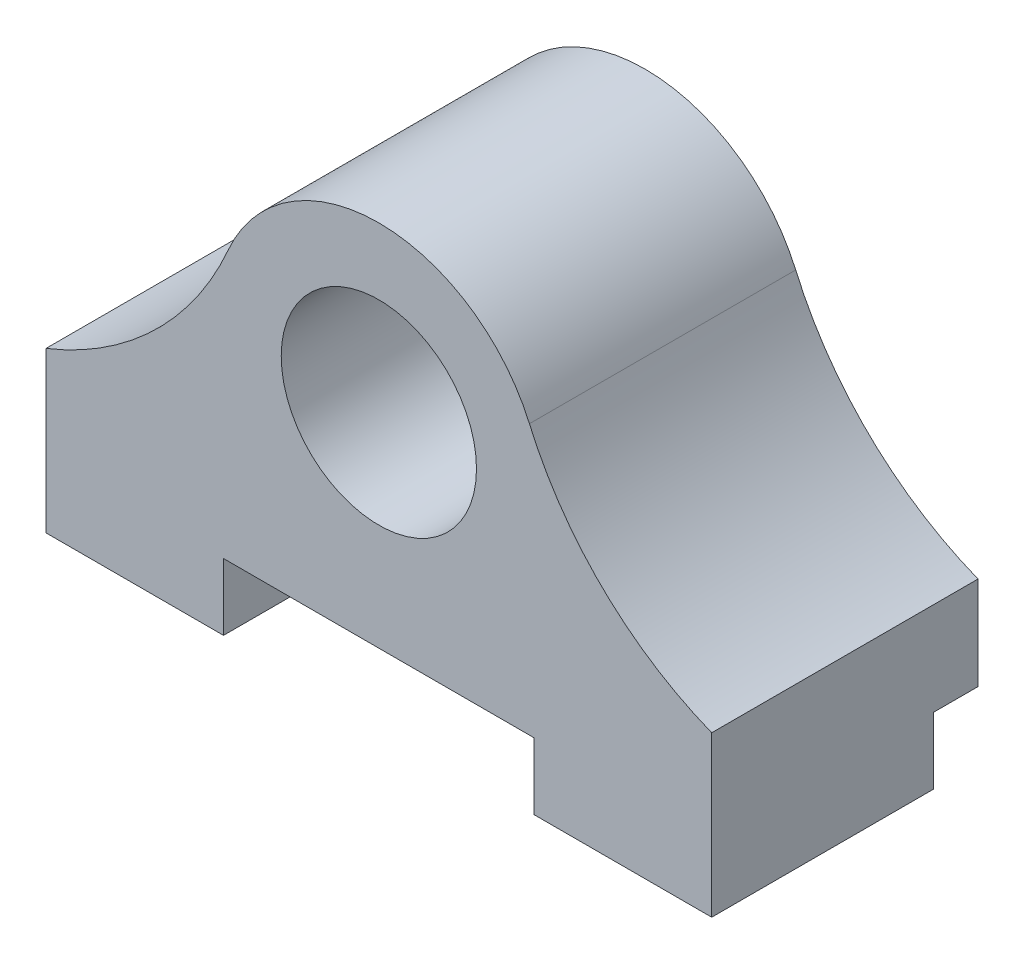
ISO-10303-21;
HEADER;
FILE_DESCRIPTION(('STEP AP214'),'2;1');
FILE_NAME('part.step','',(''),(''),'','','');
FILE_SCHEMA(('AUTOMOTIVE_DESIGN { 1 0 10303 214 1 1 1 1 }'));
ENDSEC;
DATA;
#1=APPLICATION_CONTEXT('core data for automotive mechanical design processes');
#2=APPLICATION_PROTOCOL_DEFINITION('international standard','automotive_design',2000,#1);
#3=PRODUCT_CONTEXT('',#1,'mechanical');
#4=PRODUCT('Part','Part','',(#3));
#5=PRODUCT_RELATED_PRODUCT_CATEGORY('part','',(#4));
#6=PRODUCT_DEFINITION_FORMATION('','',#4);
#7=PRODUCT_DEFINITION_CONTEXT('part definition',#1,'design');
#8=PRODUCT_DEFINITION('design','',#6,#7);
#9=PRODUCT_DEFINITION_SHAPE('','',#8);
#10=(LENGTH_UNIT() NAMED_UNIT(*) SI_UNIT(.MILLI.,.METRE.));
#11=(NAMED_UNIT(*) PLANE_ANGLE_UNIT() SI_UNIT($,.RADIAN.));
#12=(NAMED_UNIT(*) SI_UNIT($,.STERADIAN.) SOLID_ANGLE_UNIT());
#13=UNCERTAINTY_MEASURE_WITH_UNIT(LENGTH_MEASURE(1.E-05),#10,'distance_accuracy_value','');
#14=(GEOMETRIC_REPRESENTATION_CONTEXT(3) GLOBAL_UNCERTAINTY_ASSIGNED_CONTEXT((#13)) GLOBAL_UNIT_ASSIGNED_CONTEXT((#10,
#11,#12)) REPRESENTATION_CONTEXT('',''));
#15=CARTESIAN_POINT('',(0.,0.,0.));
#16=DIRECTION('',(0.,0.,1.));
#17=DIRECTION('',(1.,0.,0.));
#18=AXIS2_PLACEMENT_3D('',#15,#16,#17);
#19=CARTESIAN_POINT('',(0.,-12.2,0.));
#20=DIRECTION('',(0.,-1.,0.));
#21=DIRECTION('',(0.,0.,-1.));
#22=AXIS2_PLACEMENT_3D('',#19,#20,#21);
#23=PLANE('',#22);
#24=DIRECTION('',(0.,0.,1.));
#25=VECTOR('',#24,1.);
#26=CARTESIAN_POINT('',(6.99999999999999,-12.2,-2.));
#27=LINE('',#26,#25);
#28=CARTESIAN_POINT('',(6.99999999999999,-12.2,0.));
#29=VERTEX_POINT('',#28);
#30=CARTESIAN_POINT('',(6.99999999999999,-12.2,10.));
#31=VERTEX_POINT('',#30);
#32=EDGE_CURVE('E137',#29,#31,#27,.T.);
#33=ORIENTED_EDGE('',*,*,#32,.F.);
#34=DIRECTION('',(-1.,0.,0.));
#35=VECTOR('',#34,1.);
#36=CARTESIAN_POINT('',(15.,-12.2,0.));
#37=LINE('',#36,#35);
#38=CARTESIAN_POINT('',(15.,-12.2,0.));
#39=VERTEX_POINT('',#38);
#40=EDGE_CURVE('E158',#39,#29,#37,.T.);
#41=ORIENTED_EDGE('',*,*,#40,.F.);
#42=DIRECTION('',(0.,0.,1.));
#43=VECTOR('',#42,1.);
#44=CARTESIAN_POINT('',(15.,-12.2,10.));
#45=LINE('',#44,#43);
#46=CARTESIAN_POINT('',(15.,-12.2,10.));
#47=VERTEX_POINT('',#46);
#48=EDGE_CURVE('E188',#39,#47,#45,.T.);
#49=ORIENTED_EDGE('',*,*,#48,.T.);
#50=DIRECTION('',(-1.,0.,0.));
#51=VECTOR('',#50,1.);
#52=CARTESIAN_POINT('',(-15.,-12.2,10.));
#53=LINE('',#52,#51);
#54=EDGE_CURVE('E190',#47,#31,#53,.T.);
#55=ORIENTED_EDGE('',*,*,#54,.T.);
#56=EDGE_LOOP('',(#33,#41,#49,#55));
#57=FACE_BOUND('',#56,.T.);
#58=CARTESIAN_POINT('',(11.5,-12.2,4.));
#59=DIRECTION('',(0.,-1.,0.));
#60=DIRECTION('',(0.,0.,-1.));
#61=AXIS2_PLACEMENT_3D('',#58,#59,#60);
#62=CIRCLE('',#61,1.65);
#63=CARTESIAN_POINT('',(11.5,-12.2,2.35));
#64=VERTEX_POINT('',#63);
#65=EDGE_CURVE('E181',#64,#64,#62,.T.);
#66=ORIENTED_EDGE('',*,*,#65,.F.);
#67=EDGE_LOOP('',(#66));
#68=FACE_BOUND('',#67,.T.);
#69=ADVANCED_FACE('F39',(#57,#68),#23,.T.);
#70=CARTESIAN_POINT('',(0.,0.,0.));
#71=DIRECTION('',(0.,0.,1.));
#72=DIRECTION('',(1.,0.,0.));
#73=AXIS2_PLACEMENT_3D('',#70,#71,#72);
#74=PLANE('',#73);
#75=ORIENTED_EDGE('',*,*,#40,.T.);
#76=DIRECTION('',(0.,1.,0.));
#77=VECTOR('',#76,1.);
#78=CARTESIAN_POINT('',(6.99999999999999,0.,0.));
#79=LINE('',#78,#77);
#80=CARTESIAN_POINT('',(6.99999999999999,-9.2,0.));
#81=VERTEX_POINT('',#80);
#82=EDGE_CURVE('E11',#29,#81,#79,.T.);
#83=ORIENTED_EDGE('',*,*,#82,.T.);
#84=DIRECTION('',(1.,0.,0.));
#85=VECTOR('',#84,1.);
#86=CARTESIAN_POINT('',(15.,-9.2,0.));
#87=LINE('',#86,#85);
#88=CARTESIAN_POINT('',(15.,-9.2,0.));
#89=VERTEX_POINT('',#88);
#90=EDGE_CURVE('E162',#81,#89,#87,.T.);
#91=ORIENTED_EDGE('',*,*,#90,.T.);
#92=DIRECTION('',(0.,-1.,0.));
#93=VECTOR('',#92,1.);
#94=CARTESIAN_POINT('',(15.,-12.2,0.));
#95=LINE('',#94,#93);
#96=EDGE_CURVE('E62',#89,#39,#95,.T.);
#97=ORIENTED_EDGE('',*,*,#96,.T.);
#98=EDGE_LOOP('',(#75,#83,#91,#97));
#99=FACE_BOUND('',#98,.T.);
#100=ADVANCED_FACE('F268',(#99),#74,.F.);
#101=CARTESIAN_POINT('',(0.,0.,-2.));
#102=DIRECTION('',(0.,0.,1.));
#103=DIRECTION('',(1.,0.,0.));
#104=AXIS2_PLACEMENT_3D('',#101,#102,#103);
#105=PLANE('',#104);
#106=DIRECTION('',(1.,0.,0.));
#107=VECTOR('',#106,1.);
#108=CARTESIAN_POINT('',(0.,-9.2,-2.));
#109=LINE('',#108,#107);
#110=CARTESIAN_POINT('',(-15.,-9.2,-2.));
#111=VERTEX_POINT('',#110);
#112=CARTESIAN_POINT('',(15.,-9.2,-2.));
#113=VERTEX_POINT('',#112);
#114=EDGE_CURVE('E171',#111,#113,#109,.T.);
#115=ORIENTED_EDGE('',*,*,#114,.F.);
#116=DIRECTION('',(0.,1.,0.));
#117=VECTOR('',#116,1.);
#118=CARTESIAN_POINT('',(-15.,-12.2,-2.));
#119=LINE('',#118,#117);
#120=CARTESIAN_POINT('',(-15.,-5.,-2.));
#121=VERTEX_POINT('',#120);
#122=EDGE_CURVE('E199',#111,#121,#119,.T.);
#123=ORIENTED_EDGE('',*,*,#122,.T.);
#124=CARTESIAN_POINT('',(-20.5386621432639,8.93998642979166,-2.));
#125=DIRECTION('',(0.,0.,1.));
#126=DIRECTION('',(1.,0.,0.));
#127=AXIS2_PLACEMENT_3D('',#124,#125,#126);
#128=CIRCLE('',#127,15.);
#129=CARTESIAN_POINT('',(-6.78509374375682,2.9533883741276,-2.));
#130=VERTEX_POINT('',#129);
#131=EDGE_CURVE('E204',#130,#121,#128,.F.);
#132=ORIENTED_EDGE('',*,*,#131,.F.);
#133=CARTESIAN_POINT('',(0.,0.,-2.));
#134=DIRECTION('',(0.,0.,1.));
#135=DIRECTION('',(1.,0.,0.));
#136=AXIS2_PLACEMENT_3D('',#133,#134,#135);
#137=CIRCLE('',#136,7.4);
#138=CARTESIAN_POINT('',(6.78509374375682,2.9533883741276,-2.));
#139=VERTEX_POINT('',#138);
#140=EDGE_CURVE('E201',#130,#139,#137,.F.);
#141=ORIENTED_EDGE('',*,*,#140,.T.);
#142=CARTESIAN_POINT('',(20.5386621432639,8.93998642979166,-2.));
#143=DIRECTION('',(0.,0.,1.));
#144=DIRECTION('',(1.,0.,0.));
#145=AXIS2_PLACEMENT_3D('',#142,#143,#144);
#146=CIRCLE('',#145,15.);
#147=CARTESIAN_POINT('',(15.,-5.,-2.));
#148=VERTEX_POINT('',#147);
#149=EDGE_CURVE('E207',#139,#148,#146,.T.);
#150=ORIENTED_EDGE('',*,*,#149,.T.);
#151=DIRECTION('',(0.,1.,0.));
#152=VECTOR('',#151,1.);
#153=CARTESIAN_POINT('',(15.,-12.2,-2.));
#154=LINE('',#153,#152);
#155=EDGE_CURVE('E197',#113,#148,#154,.T.);
#156=ORIENTED_EDGE('',*,*,#155,.F.);
#157=EDGE_LOOP('',(#115,#123,#132,#141,#150,#156));
#158=FACE_BOUND('',#157,.T.);
#159=ADVANCED_FACE('F247',(#158),#105,.F.);
#160=CARTESIAN_POINT('',(-15.,-12.2,10.));
#161=DIRECTION('',(1.,0.,0.));
#162=DIRECTION('',(0.,0.,-1.));
#163=AXIS2_PLACEMENT_3D('',#160,#161,#162);
#164=PLANE('',#163);
#165=DIRECTION('',(0.,0.,1.));
#166=VECTOR('',#165,1.);
#167=CARTESIAN_POINT('',(-15.,-9.2,-2.000012));
#168=LINE('',#167,#166);
#169=CARTESIAN_POINT('',(-15.,-9.2,0.));
#170=VERTEX_POINT('',#169);
#171=EDGE_CURVE('E168',#111,#170,#168,.T.);
#172=ORIENTED_EDGE('',*,*,#171,.T.);
#173=DIRECTION('',(0.,1.,0.));
#174=VECTOR('',#173,1.);
#175=CARTESIAN_POINT('',(-15.,-12.2,0.));
#176=LINE('',#175,#174);
#177=CARTESIAN_POINT('',(-15.,-12.2,0.));
#178=VERTEX_POINT('',#177);
#179=EDGE_CURVE('E160',#178,#170,#176,.T.);
#180=ORIENTED_EDGE('',*,*,#179,.F.);
#181=DIRECTION('',(0.,0.,-1.));
#182=VECTOR('',#181,1.);
#183=CARTESIAN_POINT('',(-15.,-12.2,10.));
#184=LINE('',#183,#182);
#185=CARTESIAN_POINT('',(-15.,-12.2,10.));
#186=VERTEX_POINT('',#185);
#187=EDGE_CURVE('E177',#186,#178,#184,.T.);
#188=ORIENTED_EDGE('',*,*,#187,.F.);
#189=DIRECTION('',(0.,1.,0.));
#190=VECTOR('',#189,1.);
#191=CARTESIAN_POINT('',(-15.,-12.2,10.));
#192=LINE('',#191,#190);
#193=CARTESIAN_POINT('',(-15.,-5.,10.));
#194=VERTEX_POINT('',#193);
#195=EDGE_CURVE('E193',#186,#194,#192,.T.);
#196=ORIENTED_EDGE('',*,*,#195,.T.);
#197=DIRECTION('',(0.,0.,-1.));
#198=VECTOR('',#197,1.);
#199=CARTESIAN_POINT('',(-15.,-5.,10.));
#200=LINE('',#199,#198);
#201=EDGE_CURVE('E230',#194,#121,#200,.T.);
#202=ORIENTED_EDGE('',*,*,#201,.T.);
#203=ORIENTED_EDGE('',*,*,#122,.F.);
#204=EDGE_LOOP('',(#172,#180,#188,#196,#202,#203));
#205=FACE_BOUND('',#204,.T.);
#206=ADVANCED_FACE('F241',(#205),#164,.F.);
#207=CARTESIAN_POINT('',(15.,-12.2,10.));
#208=DIRECTION('',(-1.,0.,0.));
#209=DIRECTION('',(0.,0.,1.));
#210=AXIS2_PLACEMENT_3D('',#207,#208,#209);
#211=PLANE('',#210);
#212=DIRECTION('',(0.,0.,1.));
#213=VECTOR('',#212,1.);
#214=CARTESIAN_POINT('',(15.,-9.2,-2.000012));
#215=LINE('',#214,#213);
#216=EDGE_CURVE('E165',#113,#89,#215,.T.);
#217=ORIENTED_EDGE('',*,*,#216,.F.);
#218=ORIENTED_EDGE('',*,*,#155,.T.);
#219=DIRECTION('',(0.,0.,-1.));
#220=VECTOR('',#219,1.);
#221=CARTESIAN_POINT('',(15.,-5.,10.));
#222=LINE('',#221,#220);
#223=CARTESIAN_POINT('',(15.,-5.,10.));
#224=VERTEX_POINT('',#223);
#225=EDGE_CURVE('E227',#224,#148,#222,.T.);
#226=ORIENTED_EDGE('',*,*,#225,.F.);
#227=DIRECTION('',(0.,1.,0.));
#228=VECTOR('',#227,1.);
#229=CARTESIAN_POINT('',(15.,-12.2,10.));
#230=LINE('',#229,#228);
#231=EDGE_CURVE('E195',#47,#224,#230,.T.);
#232=ORIENTED_EDGE('',*,*,#231,.F.);
#233=ORIENTED_EDGE('',*,*,#48,.F.);
#234=ORIENTED_EDGE('',*,*,#96,.F.);
#235=EDGE_LOOP('',(#217,#218,#226,#232,#233,#234));
#236=FACE_BOUND('',#235,.T.);
#237=ADVANCED_FACE('F265',(#236),#211,.F.);
#238=CARTESIAN_POINT('',(-20.5386621432639,8.93998642979166,10.));
#239=DIRECTION('',(0.,0.,-1.));
#240=DIRECTION('',(-1.,0.,0.));
#241=AXIS2_PLACEMENT_3D('',#238,#239,#240);
#242=PLANE('',#241);
#243=DIRECTION('',(1.,0.,0.));
#244=VECTOR('',#243,1.);
#245=CARTESIAN_POINT('',(-20.5386621432639,-9.2,10.));
#246=LINE('',#245,#244);
#247=CARTESIAN_POINT('',(-7.00000000000001,-9.2,10.));
#248=VERTEX_POINT('',#247);
#249=CARTESIAN_POINT('',(6.99999999999999,-9.2,10.));
#250=VERTEX_POINT('',#249);
#251=EDGE_CURVE('E129',#248,#250,#246,.T.);
#252=ORIENTED_EDGE('',*,*,#251,.T.);
#253=DIRECTION('',(0.,-1.,0.));
#254=VECTOR('',#253,1.);
#255=CARTESIAN_POINT('',(7.,8.93998642979166,10.));
#256=LINE('',#255,#254);
#257=EDGE_CURVE('E151',#250,#31,#256,.T.);
#258=ORIENTED_EDGE('',*,*,#257,.T.);
#259=ORIENTED_EDGE('',*,*,#54,.F.);
#260=ORIENTED_EDGE('',*,*,#231,.T.);
#261=CARTESIAN_POINT('',(20.5386621432639,8.93998642979166,10.));
#262=DIRECTION('',(0.,0.,-1.));
#263=DIRECTION('',(1.,0.,0.));
#264=AXIS2_PLACEMENT_3D('',#261,#262,#263);
#265=CIRCLE('',#264,15.);
#266=CARTESIAN_POINT('',(6.78509374375682,2.9533883741276,10.));
#267=VERTEX_POINT('',#266);
#268=EDGE_CURVE('E219',#224,#267,#265,.T.);
#269=ORIENTED_EDGE('',*,*,#268,.T.);
#270=CARTESIAN_POINT('',(0.,0.,10.));
#271=DIRECTION('',(0.,0.,1.));
#272=DIRECTION('',(-1.,0.,0.));
#273=AXIS2_PLACEMENT_3D('',#270,#271,#272);
#274=CIRCLE('',#273,7.4);
#275=CARTESIAN_POINT('',(-6.78509374375682,2.9533883741276,10.));
#276=VERTEX_POINT('',#275);
#277=EDGE_CURVE('E221',#267,#276,#274,.T.);
#278=ORIENTED_EDGE('',*,*,#277,.T.);
#279=CARTESIAN_POINT('',(-20.5386621432639,8.93998642979166,10.));
#280=DIRECTION('',(0.,0.,-1.));
#281=DIRECTION('',(-1.,0.,0.));
#282=AXIS2_PLACEMENT_3D('',#279,#280,#281);
#283=CIRCLE('',#282,15.);
#284=EDGE_CURVE('E214',#276,#194,#283,.T.);
#285=ORIENTED_EDGE('',*,*,#284,.T.);
#286=ORIENTED_EDGE('',*,*,#195,.F.);
#287=CARTESIAN_POINT('',(-7.00000000000001,-12.2,10.));
#288=VERTEX_POINT('',#287);
#289=EDGE_CURVE('E150',#288,#186,#53,.T.);
#290=ORIENTED_EDGE('',*,*,#289,.F.);
#291=DIRECTION('',(0.,1.,0.));
#292=VECTOR('',#291,1.);
#293=CARTESIAN_POINT('',(-7.00000000000001,8.93998642979166,10.));
#294=LINE('',#293,#292);
#295=EDGE_CURVE('E136',#288,#248,#294,.T.);
#296=ORIENTED_EDGE('',*,*,#295,.T.);
#297=EDGE_LOOP('',(#252,#258,#259,#260,#269,#278,#285,#286,#290,#296));
#298=FACE_BOUND('',#297,.T.);
#299=CARTESIAN_POINT('',(0.,0.,10.));
#300=DIRECTION('',(0.,0.,1.));
#301=DIRECTION('',(1.,0.,0.));
#302=AXIS2_PLACEMENT_3D('',#299,#300,#301);
#303=CIRCLE('',#302,4.4);
#304=CARTESIAN_POINT('',(4.4,0.,10.));
#305=VERTEX_POINT('',#304);
#306=EDGE_CURVE('E211',#305,#305,#303,.T.);
#307=ORIENTED_EDGE('',*,*,#306,.F.);
#308=EDGE_LOOP('',(#307));
#309=FACE_BOUND('',#308,.T.);
#310=ADVANCED_FACE('F147',(#298,#309),#242,.F.);
#311=CARTESIAN_POINT('',(-20.5386621432639,8.93998642979166,10.));
#312=DIRECTION('',(0.,0.,-1.));
#313=DIRECTION('',(-1.,0.,0.));
#314=AXIS2_PLACEMENT_3D('',#311,#312,#313);
#315=CYLINDRICAL_SURFACE('',#314,15.);
#316=DIRECTION('',(0.,0.,-1.));
#317=VECTOR('',#316,1.);
#318=CARTESIAN_POINT('',(-6.78509374375682,2.9533883741276,10.));
#319=LINE('',#318,#317);
#320=EDGE_CURVE('E223',#276,#130,#319,.T.);
#321=ORIENTED_EDGE('',*,*,#320,.T.);
#322=ORIENTED_EDGE('',*,*,#131,.T.);
#323=ORIENTED_EDGE('',*,*,#201,.F.);
#324=ORIENTED_EDGE('',*,*,#284,.F.);
#325=EDGE_LOOP('',(#321,#322,#323,#324));
#326=FACE_BOUND('',#325,.T.);
#327=ADVANCED_FACE('F41',(#326),#315,.F.);
#328=CARTESIAN_POINT('',(20.5386621432639,8.93998642979166,10.));
#329=DIRECTION('',(0.,0.,-1.));
#330=DIRECTION('',(-1.,0.,0.));
#331=AXIS2_PLACEMENT_3D('',#328,#329,#330);
#332=CYLINDRICAL_SURFACE('',#331,15.);
#333=ORIENTED_EDGE('',*,*,#225,.T.);
#334=ORIENTED_EDGE('',*,*,#149,.F.);
#335=DIRECTION('',(0.,0.,-1.));
#336=VECTOR('',#335,1.);
#337=CARTESIAN_POINT('',(6.78509374375682,2.9533883741276,10.));
#338=LINE('',#337,#336);
#339=EDGE_CURVE('E225',#267,#139,#338,.T.);
#340=ORIENTED_EDGE('',*,*,#339,.F.);
#341=ORIENTED_EDGE('',*,*,#268,.F.);
#342=EDGE_LOOP('',(#333,#334,#340,#341));
#343=FACE_BOUND('',#342,.T.);
#344=ADVANCED_FACE('F261',(#343),#332,.F.);
#345=CARTESIAN_POINT('',(0.,0.,10.));
#346=DIRECTION('',(0.,0.,-1.));
#347=DIRECTION('',(-1.,0.,0.));
#348=AXIS2_PLACEMENT_3D('',#345,#346,#347);
#349=CYLINDRICAL_SURFACE('',#348,7.4);
#350=ORIENTED_EDGE('',*,*,#339,.T.);
#351=ORIENTED_EDGE('',*,*,#140,.F.);
#352=ORIENTED_EDGE('',*,*,#320,.F.);
#353=ORIENTED_EDGE('',*,*,#277,.F.);
#354=EDGE_LOOP('',(#350,#351,#352,#353));
#355=FACE_BOUND('',#354,.T.);
#356=ADVANCED_FACE('F256',(#355),#349,.T.);
#357=CARTESIAN_POINT('',(0.,0.,10.));
#358=DIRECTION('',(0.,0.,-1.));
#359=DIRECTION('',(-1.,0.,0.));
#360=AXIS2_PLACEMENT_3D('',#357,#358,#359);
#361=CYLINDRICAL_SURFACE('',#360,4.4);
#362=ORIENTED_EDGE('',*,*,#306,.T.);
#363=EDGE_LOOP('',(#362));
#364=FACE_BOUND('',#363,.T.);
#365=CARTESIAN_POINT('',(0.,0.,0.));
#366=DIRECTION('',(0.,0.,1.));
#367=DIRECTION('',(1.,0.,0.));
#368=AXIS2_PLACEMENT_3D('',#365,#366,#367);
#369=CIRCLE('',#368,4.4);
#370=CARTESIAN_POINT('',(4.4,0.,0.));
#371=VERTEX_POINT('',#370);
#372=EDGE_CURVE('E210',#371,#371,#369,.T.);
#373=ORIENTED_EDGE('',*,*,#372,.F.);
#374=EDGE_LOOP('',(#373));
#375=FACE_BOUND('',#374,.T.);
#376=ADVANCED_FACE('F306',(#364,#375),#361,.F.);
#377=CARTESIAN_POINT('',(0.,0.,0.));
#378=DIRECTION('',(0.,0.,1.));
#379=DIRECTION('',(1.,0.,0.));
#380=AXIS2_PLACEMENT_3D('',#377,#378,#379);
#381=PLANE('',#380);
#382=ORIENTED_EDGE('',*,*,#372,.T.);
#383=EDGE_LOOP('',(#382));
#384=FACE_BOUND('',#383,.T.);
#385=ADVANCED_FACE('F293',(#384),#381,.T.);
#386=DIRECTION('',(0.,0.,1.));
#387=VECTOR('',#386,1.);
#388=CARTESIAN_POINT('',(-7.00000000000001,-12.2,-2.));
#389=LINE('',#388,#387);
#390=CARTESIAN_POINT('',(-7.00000000000001,-12.2,0.));
#391=VERTEX_POINT('',#390);
#392=EDGE_CURVE('E144',#391,#288,#389,.T.);
#393=ORIENTED_EDGE('',*,*,#392,.T.);
#394=ORIENTED_EDGE('',*,*,#289,.T.);
#395=ORIENTED_EDGE('',*,*,#187,.T.);
#396=EDGE_CURVE('E157',#391,#178,#37,.T.);
#397=ORIENTED_EDGE('',*,*,#396,.F.);
#398=EDGE_LOOP('',(#393,#394,#395,#397));
#399=FACE_BOUND('',#398,.T.);
#400=CARTESIAN_POINT('',(-11.5,-12.2,4.));
#401=DIRECTION('',(0.,-1.,0.));
#402=DIRECTION('',(0.,0.,-1.));
#403=AXIS2_PLACEMENT_3D('',#400,#401,#402);
#404=CIRCLE('',#403,1.65);
#405=CARTESIAN_POINT('',(-11.5,-12.2,2.35));
#406=VERTEX_POINT('',#405);
#407=EDGE_CURVE('E178',#406,#406,#404,.T.);
#408=ORIENTED_EDGE('',*,*,#407,.F.);
#409=EDGE_LOOP('',(#408));
#410=FACE_BOUND('',#409,.T.);
#411=ADVANCED_FACE('F237',(#399,#410),#23,.T.);
#412=CARTESIAN_POINT('',(11.5,-4.2,4.));
#413=DIRECTION('',(0.,-1.,0.));
#414=DIRECTION('',(0.,0.,-1.));
#415=AXIS2_PLACEMENT_3D('',#412,#413,#414);
#416=CYLINDRICAL_SURFACE('',#415,1.65);
#417=CARTESIAN_POINT('',(11.5,-4.2,4.));
#418=DIRECTION('',(0.,-1.,0.));
#419=DIRECTION('',(0.,0.,-1.));
#420=AXIS2_PLACEMENT_3D('',#417,#418,#419);
#421=CIRCLE('',#420,1.65);
#422=CARTESIAN_POINT('',(11.5,-4.2,2.35));
#423=VERTEX_POINT('',#422);
#424=EDGE_CURVE('E173',#423,#423,#421,.T.);
#425=ORIENTED_EDGE('',*,*,#424,.F.);
#426=EDGE_LOOP('',(#425));
#427=FACE_BOUND('',#426,.T.);
#428=ORIENTED_EDGE('',*,*,#65,.T.);
#429=EDGE_LOOP('',(#428));
#430=FACE_BOUND('',#429,.T.);
#431=ADVANCED_FACE('F280',(#427,#430),#416,.F.);
#432=CARTESIAN_POINT('',(11.5,-4.2,4.));
#433=DIRECTION('',(0.,-1.,0.));
#434=DIRECTION('',(0.,0.,-1.));
#435=AXIS2_PLACEMENT_3D('',#432,#433,#434);
#436=PLANE('',#435);
#437=ORIENTED_EDGE('',*,*,#424,.T.);
#438=EDGE_LOOP('',(#437));
#439=FACE_BOUND('',#438,.T.);
#440=ADVANCED_FACE('F282',(#439),#436,.T.);
#441=CARTESIAN_POINT('',(-11.5,-4.2,4.));
#442=DIRECTION('',(0.,-1.,0.));
#443=DIRECTION('',(0.,0.,-1.));
#444=AXIS2_PLACEMENT_3D('',#441,#442,#443);
#445=CYLINDRICAL_SURFACE('',#444,1.65);
#446=CARTESIAN_POINT('',(-11.5,-4.2,4.));
#447=DIRECTION('',(0.,-1.,0.));
#448=DIRECTION('',(0.,0.,-1.));
#449=AXIS2_PLACEMENT_3D('',#446,#447,#448);
#450=CIRCLE('',#449,1.65);
#451=CARTESIAN_POINT('',(-11.5,-4.2,2.35));
#452=VERTEX_POINT('',#451);
#453=EDGE_CURVE('E174',#452,#452,#450,.T.);
#454=ORIENTED_EDGE('',*,*,#453,.F.);
#455=EDGE_LOOP('',(#454));
#456=FACE_BOUND('',#455,.T.);
#457=ORIENTED_EDGE('',*,*,#407,.T.);
#458=EDGE_LOOP('',(#457));
#459=FACE_BOUND('',#458,.T.);
#460=ADVANCED_FACE('F289',(#456,#459),#445,.F.);
#461=CARTESIAN_POINT('',(-11.5,-4.2,4.));
#462=DIRECTION('',(0.,-1.,0.));
#463=DIRECTION('',(0.,0.,-1.));
#464=AXIS2_PLACEMENT_3D('',#461,#462,#463);
#465=PLANE('',#464);
#466=ORIENTED_EDGE('',*,*,#453,.T.);
#467=EDGE_LOOP('',(#466));
#468=FACE_BOUND('',#467,.T.);
#469=ADVANCED_FACE('F385',(#468),#465,.T.);
#470=CARTESIAN_POINT('',(15.,-9.2,-2.000012));
#471=DIRECTION('',(0.,-1.,0.));
#472=DIRECTION('',(0.,0.,-1.));
#473=AXIS2_PLACEMENT_3D('',#470,#471,#472);
#474=PLANE('',#473);
#475=ORIENTED_EDGE('',*,*,#114,.T.);
#476=ORIENTED_EDGE('',*,*,#216,.T.);
#477=ORIENTED_EDGE('',*,*,#90,.F.);
#478=DIRECTION('',(0.,0.,1.));
#479=VECTOR('',#478,1.);
#480=CARTESIAN_POINT('',(6.99999999999999,-9.2,-2.));
#481=LINE('',#480,#479);
#482=EDGE_CURVE('E132',#81,#250,#481,.T.);
#483=ORIENTED_EDGE('',*,*,#482,.T.);
#484=ORIENTED_EDGE('',*,*,#251,.F.);
#485=DIRECTION('',(0.,0.,1.));
#486=VECTOR('',#485,1.);
#487=CARTESIAN_POINT('',(-7.00000000000001,-9.2,-2.));
#488=LINE('',#487,#486);
#489=CARTESIAN_POINT('',(-7.00000000000001,-9.2,0.));
#490=VERTEX_POINT('',#489);
#491=EDGE_CURVE('E54',#490,#248,#488,.T.);
#492=ORIENTED_EDGE('',*,*,#491,.F.);
#493=EDGE_CURVE('E163',#170,#490,#87,.T.);
#494=ORIENTED_EDGE('',*,*,#493,.F.);
#495=ORIENTED_EDGE('',*,*,#171,.F.);
#496=EDGE_LOOP('',(#475,#476,#477,#483,#484,#492,#494,#495));
#497=FACE_BOUND('',#496,.T.);
#498=ADVANCED_FACE('F130',(#497),#474,.T.);
#499=ORIENTED_EDGE('',*,*,#493,.T.);
#500=DIRECTION('',(0.,-1.,0.));
#501=VECTOR('',#500,1.);
#502=CARTESIAN_POINT('',(-7.00000000000001,0.,0.));
#503=LINE('',#502,#501);
#504=EDGE_CURVE('E47',#490,#391,#503,.T.);
#505=ORIENTED_EDGE('',*,*,#504,.T.);
#506=ORIENTED_EDGE('',*,*,#396,.T.);
#507=ORIENTED_EDGE('',*,*,#179,.T.);
#508=EDGE_LOOP('',(#499,#505,#506,#507));
#509=FACE_BOUND('',#508,.T.);
#510=ADVANCED_FACE('F234',(#509),#74,.F.);
#511=CARTESIAN_POINT('',(6.99999999999999,-12.2,-2.));
#512=DIRECTION('',(1.,0.,0.));
#513=DIRECTION('',(0.,0.,-1.));
#514=AXIS2_PLACEMENT_3D('',#511,#512,#513);
#515=PLANE('',#514);
#516=ORIENTED_EDGE('',*,*,#482,.F.);
#517=ORIENTED_EDGE('',*,*,#82,.F.);
#518=ORIENTED_EDGE('',*,*,#32,.T.);
#519=ORIENTED_EDGE('',*,*,#257,.F.);
#520=EDGE_LOOP('',(#516,#517,#518,#519));
#521=FACE_BOUND('',#520,.T.);
#522=ADVANCED_FACE('F271',(#521),#515,.F.);
#523=CARTESIAN_POINT('',(-7.00000000000001,-12.2,-2.));
#524=DIRECTION('',(-1.,0.,0.));
#525=DIRECTION('',(0.,0.,1.));
#526=AXIS2_PLACEMENT_3D('',#523,#524,#525);
#527=PLANE('',#526);
#528=ORIENTED_EDGE('',*,*,#392,.F.);
#529=ORIENTED_EDGE('',*,*,#504,.F.);
#530=ORIENTED_EDGE('',*,*,#491,.T.);
#531=ORIENTED_EDGE('',*,*,#295,.F.);
#532=EDGE_LOOP('',(#528,#529,#530,#531));
#533=FACE_BOUND('',#532,.T.);
#534=ADVANCED_FACE('F140',(#533),#527,.F.);
#535=CLOSED_SHELL('',(#69,#100,#159,#206,#237,#310,#327,#344,#356,#376,#385,#411,#431,#440,#460,
#469,#498,#510,#522,#534));
#536=MANIFOLD_SOLID_BREP('B2',#535);
#537=ADVANCED_BREP_SHAPE_REPRESENTATION('',(#18,#536),#14);
#538=SHAPE_DEFINITION_REPRESENTATION(#9,#537);
ENDSEC;
END-ISO-10303-21;
